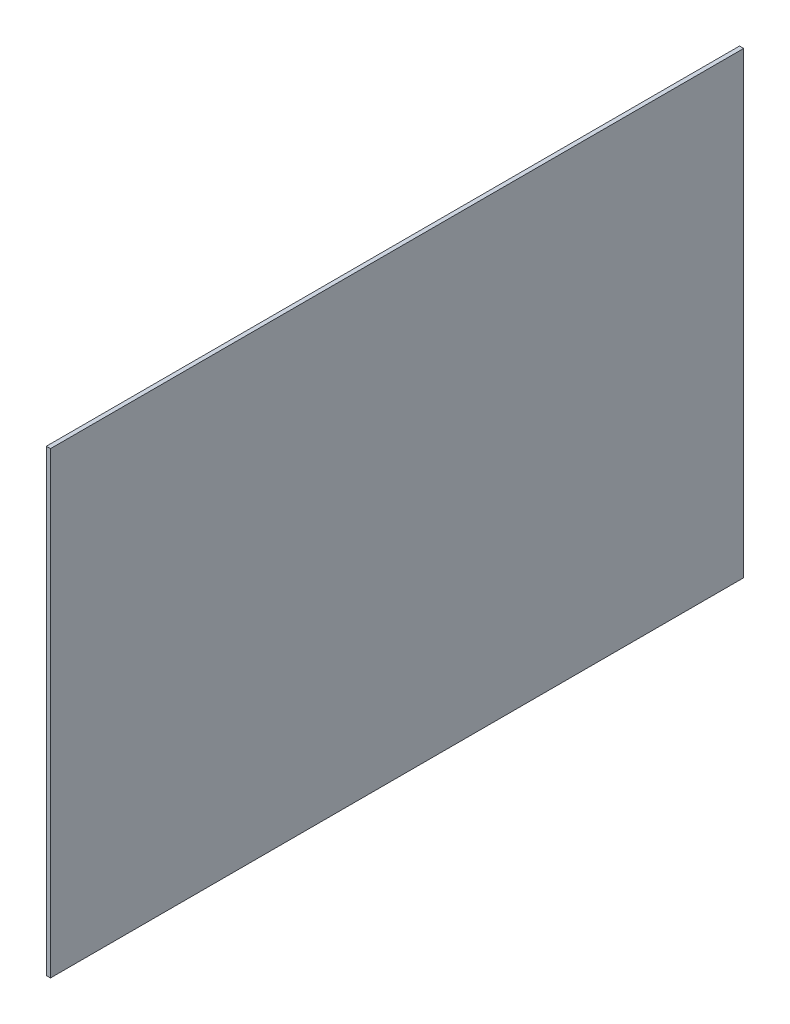
ISO-10303-21;
HEADER;
FILE_DESCRIPTION(('STEP AP214'),'2;1');
FILE_NAME('part.step','',(''),(''),'','','');
FILE_SCHEMA(('AUTOMOTIVE_DESIGN { 1 0 10303 214 1 1 1 1 }'));
ENDSEC;
DATA;
#1=APPLICATION_CONTEXT('core data for automotive mechanical design processes');
#2=APPLICATION_PROTOCOL_DEFINITION('international standard','automotive_design',2000,#1);
#3=PRODUCT_CONTEXT('',#1,'mechanical');
#4=PRODUCT('Part','Part','',(#3));
#5=PRODUCT_RELATED_PRODUCT_CATEGORY('part','',(#4));
#6=PRODUCT_DEFINITION_FORMATION('','',#4);
#7=PRODUCT_DEFINITION_CONTEXT('part definition',#1,'design');
#8=PRODUCT_DEFINITION('design','',#6,#7);
#9=PRODUCT_DEFINITION_SHAPE('','',#8);
#10=(LENGTH_UNIT() NAMED_UNIT(*) SI_UNIT(.MILLI.,.METRE.));
#11=(NAMED_UNIT(*) PLANE_ANGLE_UNIT() SI_UNIT($,.RADIAN.));
#12=(NAMED_UNIT(*) SI_UNIT($,.STERADIAN.) SOLID_ANGLE_UNIT());
#13=UNCERTAINTY_MEASURE_WITH_UNIT(LENGTH_MEASURE(1.E-05),#10,'distance_accuracy_value','');
#14=(GEOMETRIC_REPRESENTATION_CONTEXT(3) GLOBAL_UNCERTAINTY_ASSIGNED_CONTEXT((#13)) GLOBAL_UNIT_ASSIGNED_CONTEXT((#10,
#11,#12)) REPRESENTATION_CONTEXT('',''));
#15=CARTESIAN_POINT('',(0.,0.,0.));
#16=DIRECTION('',(0.,0.,1.));
#17=DIRECTION('',(1.,0.,0.));
#18=AXIS2_PLACEMENT_3D('',#15,#16,#17);
#19=CARTESIAN_POINT('',(3.,165.327172392147,250.));
#20=DIRECTION('',(0.,0.,-1.));
#21=DIRECTION('',(-1.,0.,0.));
#22=AXIS2_PLACEMENT_3D('',#19,#20,#21);
#23=PLANE('',#22);
#24=DIRECTION('',(0.,-1.,0.));
#25=VECTOR('',#24,1.);
#26=CARTESIAN_POINT('',(0.,165.327172392147,250.));
#27=LINE('',#26,#25);
#28=CARTESIAN_POINT('',(0.,165.327172392147,250.));
#29=VERTEX_POINT('',#28);
#30=CARTESIAN_POINT('',(0.,-165.327172392147,250.));
#31=VERTEX_POINT('',#30);
#32=EDGE_CURVE('E96',#29,#31,#27,.T.);
#33=ORIENTED_EDGE('',*,*,#32,.T.);
#34=DIRECTION('',(-1.,0.,0.));
#35=VECTOR('',#34,1.);
#36=CARTESIAN_POINT('',(3.,-165.327172392147,250.));
#37=LINE('',#36,#35);
#38=CARTESIAN_POINT('',(3.,-165.327172392147,250.));
#39=VERTEX_POINT('',#38);
#40=EDGE_CURVE('E11',#39,#31,#37,.T.);
#41=ORIENTED_EDGE('',*,*,#40,.F.);
#42=DIRECTION('',(0.,-1.,0.));
#43=VECTOR('',#42,1.);
#44=CARTESIAN_POINT('',(3.,165.327172392147,250.));
#45=LINE('',#44,#43);
#46=CARTESIAN_POINT('',(3.,165.327172392147,250.));
#47=VERTEX_POINT('',#46);
#48=EDGE_CURVE('E83',#47,#39,#45,.T.);
#49=ORIENTED_EDGE('',*,*,#48,.F.);
#50=DIRECTION('',(-1.,0.,0.));
#51=VECTOR('',#50,1.);
#52=CARTESIAN_POINT('',(3.,165.327172392147,250.));
#53=LINE('',#52,#51);
#54=EDGE_CURVE('E92',#47,#29,#53,.T.);
#55=ORIENTED_EDGE('',*,*,#54,.T.);
#56=EDGE_LOOP('',(#33,#41,#49,#55));
#57=FACE_BOUND('',#56,.T.);
#58=ADVANCED_FACE('F33',(#57),#23,.F.);
#59=CARTESIAN_POINT('',(3.,-165.327172392147,250.));
#60=DIRECTION('',(0.,1.,0.));
#61=DIRECTION('',(0.,0.,1.));
#62=AXIS2_PLACEMENT_3D('',#59,#60,#61);
#63=PLANE('',#62);
#64=DIRECTION('',(0.,0.,-1.));
#65=VECTOR('',#64,1.);
#66=CARTESIAN_POINT('',(0.,-165.327172392147,250.));
#67=LINE('',#66,#65);
#68=CARTESIAN_POINT('',(0.,-165.327172392147,-250.));
#69=VERTEX_POINT('',#68);
#70=EDGE_CURVE('E88',#31,#69,#67,.T.);
#71=ORIENTED_EDGE('',*,*,#70,.T.);
#72=DIRECTION('',(-1.,0.,0.));
#73=VECTOR('',#72,1.);
#74=CARTESIAN_POINT('',(3.,-165.327172392147,-250.));
#75=LINE('',#74,#73);
#76=CARTESIAN_POINT('',(3.,-165.327172392147,-250.));
#77=VERTEX_POINT('',#76);
#78=EDGE_CURVE('E41',#77,#69,#75,.T.);
#79=ORIENTED_EDGE('',*,*,#78,.F.);
#80=DIRECTION('',(0.,0.,-1.));
#81=VECTOR('',#80,1.);
#82=CARTESIAN_POINT('',(3.,-165.327172392147,250.));
#83=LINE('',#82,#81);
#84=EDGE_CURVE('E78',#39,#77,#83,.T.);
#85=ORIENTED_EDGE('',*,*,#84,.F.);
#86=ORIENTED_EDGE('',*,*,#40,.T.);
#87=EDGE_LOOP('',(#71,#79,#85,#86));
#88=FACE_BOUND('',#87,.T.);
#89=ADVANCED_FACE('F87',(#88),#63,.F.);
#90=CARTESIAN_POINT('',(3.,145.327172392147,-250.));
#91=DIRECTION('',(0.,0.,1.));
#92=DIRECTION('',(1.,0.,0.));
#93=AXIS2_PLACEMENT_3D('',#90,#91,#92);
#94=PLANE('',#93);
#95=DIRECTION('',(0.,1.,0.));
#96=VECTOR('',#95,1.);
#97=CARTESIAN_POINT('',(0.,145.327172392147,-250.));
#98=LINE('',#97,#96);
#99=CARTESIAN_POINT('',(0.,165.327172392147,-250.));
#100=VERTEX_POINT('',#99);
#101=EDGE_CURVE('E65',#69,#100,#98,.T.);
#102=ORIENTED_EDGE('',*,*,#101,.T.);
#103=DIRECTION('',(-1.,0.,0.));
#104=VECTOR('',#103,1.);
#105=CARTESIAN_POINT('',(3.,165.327172392147,-250.));
#106=LINE('',#105,#104);
#107=CARTESIAN_POINT('',(3.,165.327172392147,-250.));
#108=VERTEX_POINT('',#107);
#109=EDGE_CURVE('E89',#108,#100,#106,.T.);
#110=ORIENTED_EDGE('',*,*,#109,.F.);
#111=DIRECTION('',(0.,1.,0.));
#112=VECTOR('',#111,1.);
#113=CARTESIAN_POINT('',(3.,-165.327172392147,-250.));
#114=LINE('',#113,#112);
#115=EDGE_CURVE('E81',#77,#108,#114,.T.);
#116=ORIENTED_EDGE('',*,*,#115,.F.);
#117=ORIENTED_EDGE('',*,*,#78,.T.);
#118=EDGE_LOOP('',(#102,#110,#116,#117));
#119=FACE_BOUND('',#118,.T.);
#120=ADVANCED_FACE('F90',(#119),#94,.F.);
#121=CARTESIAN_POINT('',(3.,165.327172392147,-250.));
#122=DIRECTION('',(0.,-1.,0.));
#123=DIRECTION('',(0.,0.,-1.));
#124=AXIS2_PLACEMENT_3D('',#121,#122,#123);
#125=PLANE('',#124);
#126=DIRECTION('',(0.,0.,1.));
#127=VECTOR('',#126,1.);
#128=CARTESIAN_POINT('',(0.,165.327172392147,-250.));
#129=LINE('',#128,#127);
#130=EDGE_CURVE('E71',#100,#29,#129,.T.);
#131=ORIENTED_EDGE('',*,*,#130,.T.);
#132=ORIENTED_EDGE('',*,*,#54,.F.);
#133=DIRECTION('',(0.,0.,1.));
#134=VECTOR('',#133,1.);
#135=CARTESIAN_POINT('',(3.,165.327172392147,-250.));
#136=LINE('',#135,#134);
#137=EDGE_CURVE('E49',#108,#47,#136,.T.);
#138=ORIENTED_EDGE('',*,*,#137,.F.);
#139=ORIENTED_EDGE('',*,*,#109,.T.);
#140=EDGE_LOOP('',(#131,#132,#138,#139));
#141=FACE_BOUND('',#140,.T.);
#142=ADVANCED_FACE('F103',(#141),#125,.F.);
#143=CARTESIAN_POINT('',(3.,0.,0.));
#144=DIRECTION('',(1.,0.,0.));
#145=DIRECTION('',(0.,0.,-1.));
#146=AXIS2_PLACEMENT_3D('',#143,#144,#145);
#147=PLANE('',#146);
#148=ORIENTED_EDGE('',*,*,#48,.T.);
#149=ORIENTED_EDGE('',*,*,#84,.T.);
#150=ORIENTED_EDGE('',*,*,#115,.T.);
#151=ORIENTED_EDGE('',*,*,#137,.T.);
#152=EDGE_LOOP('',(#148,#149,#150,#151));
#153=FACE_BOUND('',#152,.T.);
#154=ADVANCED_FACE('F79',(#153),#147,.T.);
#155=CARTESIAN_POINT('',(0.,0.,0.));
#156=DIRECTION('',(1.,0.,0.));
#157=DIRECTION('',(0.,0.,-1.));
#158=AXIS2_PLACEMENT_3D('',#155,#156,#157);
#159=PLANE('',#158);
#160=ORIENTED_EDGE('',*,*,#32,.F.);
#161=ORIENTED_EDGE('',*,*,#130,.F.);
#162=ORIENTED_EDGE('',*,*,#101,.F.);
#163=ORIENTED_EDGE('',*,*,#70,.F.);
#164=EDGE_LOOP('',(#160,#161,#162,#163));
#165=FACE_BOUND('',#164,.T.);
#166=ADVANCED_FACE('F106',(#165),#159,.F.);
#167=CLOSED_SHELL('',(#58,#89,#120,#142,#154,#166));
#168=MANIFOLD_SOLID_BREP('B2',#167);
#169=ADVANCED_BREP_SHAPE_REPRESENTATION('',(#18,#168),#14);
#170=SHAPE_DEFINITION_REPRESENTATION(#9,#169);
ENDSEC;
END-ISO-10303-21;
